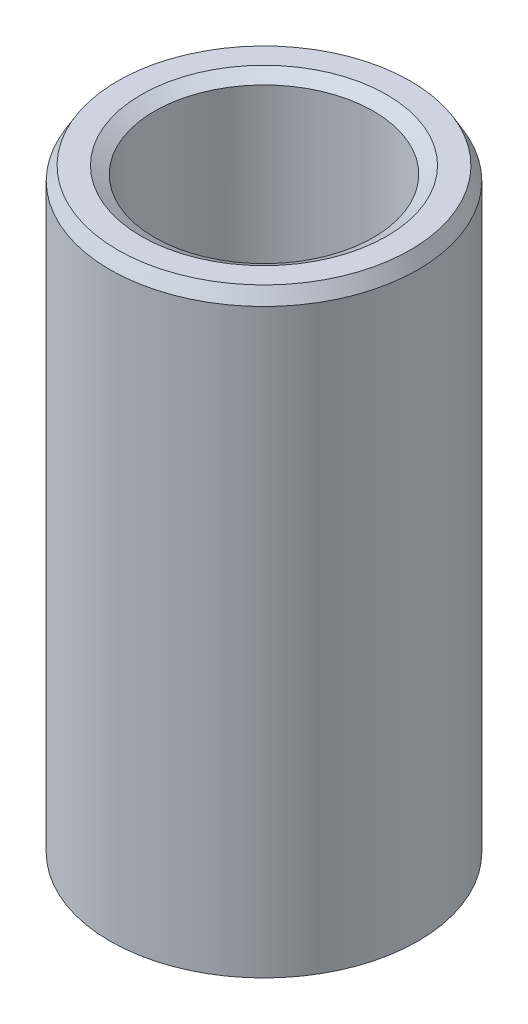
ISO-10303-21;
HEADER;
FILE_DESCRIPTION(('STEP AP214'),'2;1');
FILE_NAME('part.step','',(''),(''),'','','');
FILE_SCHEMA(('AUTOMOTIVE_DESIGN { 1 0 10303 214 1 1 1 1 }'));
ENDSEC;
DATA;
#1=APPLICATION_CONTEXT('core data for automotive mechanical design processes');
#2=APPLICATION_PROTOCOL_DEFINITION('international standard','automotive_design',2000,#1);
#3=PRODUCT_CONTEXT('',#1,'mechanical');
#4=PRODUCT('Part','Part','',(#3));
#5=PRODUCT_RELATED_PRODUCT_CATEGORY('part','',(#4));
#6=PRODUCT_DEFINITION_FORMATION('','',#4);
#7=PRODUCT_DEFINITION_CONTEXT('part definition',#1,'design');
#8=PRODUCT_DEFINITION('design','',#6,#7);
#9=PRODUCT_DEFINITION_SHAPE('','',#8);
#10=(LENGTH_UNIT() NAMED_UNIT(*) SI_UNIT(.MILLI.,.METRE.));
#11=(NAMED_UNIT(*) PLANE_ANGLE_UNIT() SI_UNIT($,.RADIAN.));
#12=(NAMED_UNIT(*) SI_UNIT($,.STERADIAN.) SOLID_ANGLE_UNIT());
#13=UNCERTAINTY_MEASURE_WITH_UNIT(LENGTH_MEASURE(1.E-05),#10,'distance_accuracy_value','');
#14=(GEOMETRIC_REPRESENTATION_CONTEXT(3) GLOBAL_UNCERTAINTY_ASSIGNED_CONTEXT((#13)) GLOBAL_UNIT_ASSIGNED_CONTEXT((#10,
#11,#12)) REPRESENTATION_CONTEXT('',''));
#15=CARTESIAN_POINT('',(0.,0.,0.));
#16=DIRECTION('',(0.,0.,1.));
#17=DIRECTION('',(1.,0.,0.));
#18=AXIS2_PLACEMENT_3D('',#15,#16,#17);
#19=CARTESIAN_POINT('',(0.,58.6751234788739,0.));
#20=DIRECTION('',(0.,-1.,0.));
#21=DIRECTION('',(0.,0.,-1.));
#22=AXIS2_PLACEMENT_3D('',#19,#20,#21);
#23=CYLINDRICAL_SURFACE('',#22,15.);
#24=CARTESIAN_POINT('',(0.,0.746168549579422,0.));
#25=DIRECTION('',(0.,1.,0.));
#26=DIRECTION('',(0.,0.,1.));
#27=AXIS2_PLACEMENT_3D('',#24,#25,#26);
#28=CIRCLE('',#27,15.);
#29=CARTESIAN_POINT('',(0.,0.746168549579422,-15.));
#30=VERTEX_POINT('',#29);
#31=EDGE_CURVE('E10',#30,#30,#28,.T.);
#32=CARTESIAN_POINT('',(0.,57.3827216399925,0.));
#33=DIRECTION('',(0.,1.,0.));
#34=DIRECTION('',(0.,0.,1.));
#35=AXIS2_PLACEMENT_3D('',#32,#33,#34);
#36=CIRCLE('',#35,15.);
#37=CARTESIAN_POINT('',(0.,57.3827216399925,-15.));
#38=VERTEX_POINT('',#37);
#39=EDGE_CURVE('E50',#38,#38,#36,.F.);
#40=CARTESIAN_POINT('',(0.,0.746168549579422,-15.));
#41=CARTESIAN_POINT('',(0.,1.33613264427123,-15.));
#42=CARTESIAN_POINT('',(0.,1.92609673896303,-15.));
#43=CARTESIAN_POINT('',(0.,3.10602492834663,-15.));
#44=CARTESIAN_POINT('',(0.,3.69598902303844,-15.));
#45=CARTESIAN_POINT('',(0.,4.87591721242204,-15.));
#46=CARTESIAN_POINT('',(0.,5.46588130711384,-15.));
#47=CARTESIAN_POINT('',(0.,6.64580949649745,-15.));
#48=CARTESIAN_POINT('',(0.,7.23577359118925,-15.));
#49=CARTESIAN_POINT('',(0.,8.41570178057286,-15.));
#50=CARTESIAN_POINT('',(0.,9.00566587526466,-15.));
#51=CARTESIAN_POINT('',(0.,10.1855940646483,-15.));
#52=CARTESIAN_POINT('',(0.,10.7755581593401,-15.));
#53=CARTESIAN_POINT('',(0.,11.9554863487237,-15.));
#54=CARTESIAN_POINT('',(0.,12.5454504434155,-15.));
#55=CARTESIAN_POINT('',(0.,13.7253786327991,-15.));
#56=CARTESIAN_POINT('',(0.,14.3153427274909,-15.));
#57=CARTESIAN_POINT('',(0.,15.4952709168745,-15.));
#58=CARTESIAN_POINT('',(0.,16.0852350115663,-15.));
#59=CARTESIAN_POINT('',(0.,17.2651632009499,-15.));
#60=CARTESIAN_POINT('',(0.,17.8551272956417,-15.));
#61=CARTESIAN_POINT('',(0.,19.0350554850253,-15.));
#62=CARTESIAN_POINT('',(0.,19.6250195797171,-15.));
#63=CARTESIAN_POINT('',(0.,20.8049477691007,-15.));
#64=CARTESIAN_POINT('',(0.,21.3949118637925,-15.));
#65=CARTESIAN_POINT('',(0.,22.5748400531761,-15.));
#66=CARTESIAN_POINT('',(0.,23.1648041478679,-15.));
#67=CARTESIAN_POINT('',(0.,24.3447323372515,-15.));
#68=CARTESIAN_POINT('',(0.,24.9346964319433,-15.));
#69=CARTESIAN_POINT('',(0.,26.1146246213269,-15.));
#70=CARTESIAN_POINT('',(0.,26.7045887160187,-15.));
#71=CARTESIAN_POINT('',(0.,27.8845169054024,-15.));
#72=CARTESIAN_POINT('',(0.,28.4744810000942,-15.));
#73=CARTESIAN_POINT('',(0.,29.6544091894778,-15.));
#74=CARTESIAN_POINT('',(0.,30.2443732841696,-15.));
#75=CARTESIAN_POINT('',(0.,31.4243014735532,-15.));
#76=CARTESIAN_POINT('',(0.,32.014265568245,-15.));
#77=CARTESIAN_POINT('',(0.,33.1941937576286,-15.));
#78=CARTESIAN_POINT('',(0.,33.7841578523204,-15.));
#79=CARTESIAN_POINT('',(0.,34.964086041704,-15.));
#80=CARTESIAN_POINT('',(0.,35.5540501363958,-15.));
#81=CARTESIAN_POINT('',(0.,36.7339783257794,-15.));
#82=CARTESIAN_POINT('',(0.,37.3239424204712,-15.));
#83=CARTESIAN_POINT('',(0.,38.5038706098548,-15.));
#84=CARTESIAN_POINT('',(0.,39.0938347045466,-15.));
#85=CARTESIAN_POINT('',(0.,40.2737628939302,-15.));
#86=CARTESIAN_POINT('',(0.,40.863726988622,-15.));
#87=CARTESIAN_POINT('',(0.,42.0436551780056,-15.));
#88=CARTESIAN_POINT('',(0.,42.6336192726974,-15.));
#89=CARTESIAN_POINT('',(0.,43.813547462081,-15.));
#90=CARTESIAN_POINT('',(0.,44.4035115567728,-15.));
#91=CARTESIAN_POINT('',(0.,45.5834397461564,-15.));
#92=CARTESIAN_POINT('',(0.,46.1734038408482,-15.));
#93=CARTESIAN_POINT('',(0.,47.3533320302318,-15.));
#94=CARTESIAN_POINT('',(0.,47.9432961249236,-15.));
#95=CARTESIAN_POINT('',(0.,49.1232243143072,-15.));
#96=CARTESIAN_POINT('',(0.,49.7131884089991,-15.));
#97=CARTESIAN_POINT('',(0.,50.8931165983827,-15.));
#98=CARTESIAN_POINT('',(0.,51.4830806930745,-15.));
#99=CARTESIAN_POINT('',(0.,52.6630088824581,-15.));
#100=CARTESIAN_POINT('',(0.,53.2529729771499,-15.));
#101=CARTESIAN_POINT('',(0.,54.4329011665335,-15.));
#102=CARTESIAN_POINT('',(0.,55.0228652612253,-15.));
#103=CARTESIAN_POINT('',(0.,56.2027934506089,-15.));
#104=CARTESIAN_POINT('',(0.,56.7927575453007,-15.));
#105=CARTESIAN_POINT('',(0.,57.3827216399925,-15.));
#106=B_SPLINE_CURVE_WITH_KNOTS('',3,(#40,#41,#42,#43,#44,#45,#46,#47,#48,#49,#50,#51,#52,#53,
#54,#55,#56,#57,#58,#59,#60,#61,#62,#63,#64,#65,#66,#67,#68,#69,#70,#71,#72,#73,#74,#75,#76,#77,
#78,#79,#80,#81,#82,#83,#84,#85,#86,#87,#88,#89,#90,#91,#92,#93,#94,#95,#96,#97,#98,#99,#100,
#101,#102,#103,#104,#105),.UNSPECIFIED.,.F.,.F.,(4,2,2,2,2,2,2,2,2,2,2,2,2,2,2,2,2,2,2,2,2,2,2,
2,2,2,2,2,2,2,2,2,4),(0.,1.76989228407541,3.53978456815082,5.30967685222623,7.07956913630163,
8.84946142037704,10.6193537044525,12.3892459885279,14.1591382726033,15.9290305566787,
17.6989228407541,19.4688151248295,21.2387074089049,23.0085996929803,24.7784919770557,
26.5483842611311,28.3182765452065,30.0881688292819,31.8580611133574,33.6279533974328,
35.3978456815082,37.1677379655836,38.937630249659,40.7075225337344,42.4774148178098,
44.2473071018852,46.0171993859606,47.787091670036,49.5569839541114,51.3268762381868,
53.0967685222623,54.8666608063377,56.6365530904131),.UNSPECIFIED.);
#107=EDGE_CURVE('BSEAM39',#30,#38,#106,.T.);
#108=ORIENTED_EDGE('',*,*,#31,.T.);
#109=ORIENTED_EDGE('',*,*,#39,.T.);
#110=ORIENTED_EDGE('',*,*,#107,.T.);
#111=ORIENTED_EDGE('',*,*,#107,.F.);
#112=EDGE_LOOP('',(#108,#110,#109,#111));
#113=FACE_BOUND('',#112,.T.);
#114=ADVANCED_FACE('F39',(#113),#23,.T.);
#115=CARTESIAN_POINT('',(0.,58.6751234788739,0.));
#116=DIRECTION('',(0.,1.,0.));
#117=DIRECTION('',(0.,0.,1.));
#118=AXIS2_PLACEMENT_3D('',#115,#116,#117);
#119=PLANE('',#118);
#120=CARTESIAN_POINT('',(0.,58.6751234788739,0.));
#121=DIRECTION('',(0.,1.,0.));
#122=DIRECTION('',(0.,0.,1.));
#123=AXIS2_PLACEMENT_3D('',#120,#121,#122);
#124=CIRCLE('',#123,11.9536355341758);
#125=CARTESIAN_POINT('',(0.,58.6751234788739,11.9536355341758));
#126=VERTEX_POINT('',#125);
#127=EDGE_CURVE('E58',#126,#126,#124,.F.);
#128=ORIENTED_EDGE('',*,*,#127,.T.);
#129=EDGE_LOOP('',(#128));
#130=FACE_BOUND('',#129,.T.);
#131=CARTESIAN_POINT('',(0.,58.6751234788739,0.));
#132=DIRECTION('',(0.,1.,0.));
#133=DIRECTION('',(0.,0.,1.));
#134=AXIS2_PLACEMENT_3D('',#131,#132,#133);
#135=CIRCLE('',#134,14.2538314504206);
#136=CARTESIAN_POINT('',(0.,58.6751234788739,14.2538314504206));
#137=VERTEX_POINT('',#136);
#138=EDGE_CURVE('E61',#137,#137,#135,.T.);
#139=ORIENTED_EDGE('',*,*,#138,.T.);
#140=EDGE_LOOP('',(#139));
#141=FACE_BOUND('',#140,.T.);
#142=ADVANCED_FACE('F88',(#130,#141),#119,.T.);
#143=CARTESIAN_POINT('',(0.,0.,0.));
#144=DIRECTION('',(0.,1.,0.));
#145=DIRECTION('',(0.,0.,1.));
#146=AXIS2_PLACEMENT_3D('',#143,#144,#145);
#147=PLANE('',#146);
#148=CARTESIAN_POINT('',(0.,0.,0.));
#149=DIRECTION('',(0.,1.,0.));
#150=DIRECTION('',(0.,0.,1.));
#151=AXIS2_PLACEMENT_3D('',#148,#149,#150);
#152=CIRCLE('',#151,11.4074022448736);
#153=CARTESIAN_POINT('',(0.,0.,11.4074022448736));
#154=VERTEX_POINT('',#153);
#155=EDGE_CURVE('E51',#154,#154,#152,.T.);
#156=ORIENTED_EDGE('',*,*,#155,.T.);
#157=EDGE_LOOP('',(#156));
#158=FACE_BOUND('',#157,.T.);
#159=CARTESIAN_POINT('',(0.,0.,0.));
#160=DIRECTION('',(0.,1.,0.));
#161=DIRECTION('',(0.,0.,1.));
#162=AXIS2_PLACEMENT_3D('',#159,#160,#161);
#163=CIRCLE('',#162,13.7075981611185);
#164=CARTESIAN_POINT('',(0.,0.,13.7075981611185));
#165=VERTEX_POINT('',#164);
#166=EDGE_CURVE('E54',#165,#165,#163,.F.);
#167=ORIENTED_EDGE('',*,*,#166,.T.);
#168=EDGE_LOOP('',(#167));
#169=FACE_BOUND('',#168,.T.);
#170=ADVANCED_FACE('F83',(#158,#169),#147,.F.);
#171=CARTESIAN_POINT('',(0.,58.6751234788739,0.));
#172=DIRECTION('',(0.,-1.,0.));
#173=DIRECTION('',(0.,0.,-1.));
#174=AXIS2_PLACEMENT_3D('',#171,#172,#173);
#175=CYLINDRICAL_SURFACE('',#174,10.6612336952942);
#176=CARTESIAN_POINT('',(0.,57.9289549292945,0.));
#177=DIRECTION('',(0.,1.,0.));
#178=DIRECTION('',(0.,0.,1.));
#179=AXIS2_PLACEMENT_3D('',#176,#177,#178);
#180=CIRCLE('',#179,10.6612336952942);
#181=CARTESIAN_POINT('',(0.,57.9289549292945,-10.6612336952942));
#182=VERTEX_POINT('',#181);
#183=EDGE_CURVE('E67',#182,#182,#180,.T.);
#184=CARTESIAN_POINT('',(0.,1.29240183888149,0.));
#185=DIRECTION('',(0.,1.,0.));
#186=DIRECTION('',(0.,0.,1.));
#187=AXIS2_PLACEMENT_3D('',#184,#185,#186);
#188=CIRCLE('',#187,10.6612336952942);
#189=CARTESIAN_POINT('',(0.,1.29240183888148,-10.6612336952942));
#190=VERTEX_POINT('',#189);
#191=EDGE_CURVE('E69',#190,#190,#188,.F.);
#192=CARTESIAN_POINT('',(0.,57.9289549292945,-10.6612336952942));
#193=CARTESIAN_POINT('',(0.,57.3389908346027,-10.6612336952942));
#194=CARTESIAN_POINT('',(0.,56.7490267399109,-10.6612336952942));
#195=CARTESIAN_POINT('',(0.,55.5690985505273,-10.6612336952942));
#196=CARTESIAN_POINT('',(0.,54.9791344558355,-10.6612336952942));
#197=CARTESIAN_POINT('',(0.,53.7992062664519,-10.6612336952942));
#198=CARTESIAN_POINT('',(0.,53.2092421717601,-10.6612336952942));
#199=CARTESIAN_POINT('',(0.,52.0293139823765,-10.6612336952942));
#200=CARTESIAN_POINT('',(0.,51.4393498876847,-10.6612336952942));
#201=CARTESIAN_POINT('',(0.,50.2594216983011,-10.6612336952942));
#202=CARTESIAN_POINT('',(0.,49.6694576036093,-10.6612336952942));
#203=CARTESIAN_POINT('',(0.,48.4895294142257,-10.6612336952942));
#204=CARTESIAN_POINT('',(0.,47.8995653195339,-10.6612336952942));
#205=CARTESIAN_POINT('',(0.,46.7196371301503,-10.6612336952942));
#206=CARTESIAN_POINT('',(0.,46.1296730354585,-10.6612336952942));
#207=CARTESIAN_POINT('',(0.,44.9497448460749,-10.6612336952942));
#208=CARTESIAN_POINT('',(0.,44.3597807513831,-10.6612336952942));
#209=CARTESIAN_POINT('',(0.,43.1798525619995,-10.6612336952942));
#210=CARTESIAN_POINT('',(0.,42.5898884673077,-10.6612336952942));
#211=CARTESIAN_POINT('',(0.,41.409960277924,-10.6612336952942));
#212=CARTESIAN_POINT('',(0.,40.8199961832322,-10.6612336952942));
#213=CARTESIAN_POINT('',(0.,39.6400679938486,-10.6612336952942));
#214=CARTESIAN_POINT('',(0.,39.0501038991568,-10.6612336952942));
#215=CARTESIAN_POINT('',(0.,37.8701757097732,-10.6612336952942));
#216=CARTESIAN_POINT('',(0.,37.2802116150814,-10.6612336952942));
#217=CARTESIAN_POINT('',(0.,36.1002834256978,-10.6612336952942));
#218=CARTESIAN_POINT('',(0.,35.510319331006,-10.6612336952942));
#219=CARTESIAN_POINT('',(0.,34.3303911416224,-10.6612336952942));
#220=CARTESIAN_POINT('',(0.,33.7404270469306,-10.6612336952942));
#221=CARTESIAN_POINT('',(0.,32.560498857547,-10.6612336952942));
#222=CARTESIAN_POINT('',(0.,31.9705347628552,-10.6612336952942));
#223=CARTESIAN_POINT('',(0.,30.7906065734716,-10.6612336952942));
#224=CARTESIAN_POINT('',(0.,30.2006424787798,-10.6612336952942));
#225=CARTESIAN_POINT('',(0.,29.0207142893962,-10.6612336952942));
#226=CARTESIAN_POINT('',(0.,28.4307501947044,-10.6612336952942));
#227=CARTESIAN_POINT('',(0.,27.2508220053208,-10.6612336952942));
#228=CARTESIAN_POINT('',(0.,26.660857910629,-10.6612336952942));
#229=CARTESIAN_POINT('',(0.,25.4809297212454,-10.6612336952942));
#230=CARTESIAN_POINT('',(0.,24.8909656265536,-10.6612336952942));
#231=CARTESIAN_POINT('',(0.,23.71103743717,-10.6612336952942));
#232=CARTESIAN_POINT('',(0.,23.1210733424782,-10.6612336952942));
#233=CARTESIAN_POINT('',(0.,21.9411451530946,-10.6612336952942));
#234=CARTESIAN_POINT('',(0.,21.3511810584028,-10.6612336952942));
#235=CARTESIAN_POINT('',(0.,20.1712528690192,-10.6612336952942));
#236=CARTESIAN_POINT('',(0.,19.5812887743274,-10.6612336952942));
#237=CARTESIAN_POINT('',(0.,18.4013605849438,-10.6612336952942));
#238=CARTESIAN_POINT('',(0.,17.811396490252,-10.6612336952942));
#239=CARTESIAN_POINT('',(0.,16.6314683008684,-10.6612336952942));
#240=CARTESIAN_POINT('',(0.,16.0415042061766,-10.6612336952942));
#241=CARTESIAN_POINT('',(0.,14.8615760167929,-10.6612336952942));
#242=CARTESIAN_POINT('',(0.,14.2716119221011,-10.6612336952942));
#243=CARTESIAN_POINT('',(0.,13.0916837327175,-10.6612336952942));
#244=CARTESIAN_POINT('',(0.,12.5017196380257,-10.6612336952942));
#245=CARTESIAN_POINT('',(0.,11.3217914486421,-10.6612336952942));
#246=CARTESIAN_POINT('',(0.,10.7318273539503,-10.6612336952942));
#247=CARTESIAN_POINT('',(0.,9.55189916456672,-10.6612336952942));
#248=CARTESIAN_POINT('',(0.,8.96193506987492,-10.6612336952942));
#249=CARTESIAN_POINT('',(0.,7.78200688049131,-10.6612336952942));
#250=CARTESIAN_POINT('',(0.,7.19204278579951,-10.6612336952942));
#251=CARTESIAN_POINT('',(0.,6.0121145964159,-10.6612336952942));
#252=CARTESIAN_POINT('',(0.,5.42215050172411,-10.6612336952942));
#253=CARTESIAN_POINT('',(0.,4.2422223123405,-10.6612336952942));
#254=CARTESIAN_POINT('',(0.,3.6522582176487,-10.6612336952942));
#255=CARTESIAN_POINT('',(0.,2.47233002826509,-10.6612336952942));
#256=CARTESIAN_POINT('',(0.,1.88236593357329,-10.6612336952942));
#257=CARTESIAN_POINT('',(0.,1.29240183888148,-10.6612336952942));
#258=B_SPLINE_CURVE_WITH_KNOTS('',3,(#192,#193,#194,#195,#196,#197,#198,#199,#200,#201,#202,
#203,#204,#205,#206,#207,#208,#209,#210,#211,#212,#213,#214,#215,#216,#217,#218,#219,#220,#221,
#222,#223,#224,#225,#226,#227,#228,#229,#230,#231,#232,#233,#234,#235,#236,#237,#238,#239,#240,
#241,#242,#243,#244,#245,#246,#247,#248,#249,#250,#251,#252,#253,#254,#255,#256,#257),
.UNSPECIFIED.,.F.,.F.,(4,2,2,2,2,2,2,2,2,2,2,2,2,2,2,2,2,2,2,2,2,2,2,2,2,2,2,2,2,2,2,2,4),(0.,
1.76989228407541,3.53978456815082,5.30967685222623,7.07956913630163,8.84946142037703,
10.6193537044524,12.3892459885279,14.1591382726033,15.9290305566787,17.6989228407541,
19.4688151248295,21.2387074089049,23.0085996929803,24.7784919770557,26.5483842611311,
28.3182765452065,30.0881688292819,31.8580611133573,33.6279533974327,35.3978456815081,
37.1677379655835,38.937630249659,40.7075225337344,42.4774148178098,44.2473071018852,
46.0171993859606,47.787091670036,49.5569839541114,51.3268762381868,53.0967685222622,
54.8666608063376,56.636553090413),.UNSPECIFIED.);
#259=EDGE_CURVE('BSEAM71',#182,#190,#258,.T.);
#260=ORIENTED_EDGE('',*,*,#183,.T.);
#261=ORIENTED_EDGE('',*,*,#191,.T.);
#262=ORIENTED_EDGE('',*,*,#259,.T.);
#263=ORIENTED_EDGE('',*,*,#259,.F.);
#264=EDGE_LOOP('',(#260,#262,#261,#263));
#265=FACE_BOUND('',#264,.T.);
#266=ADVANCED_FACE('F71',(#265),#175,.F.);
#267=CARTESIAN_POINT('',(0.,57.9289549292945,0.));
#268=DIRECTION('',(0.,1.,0.));
#269=DIRECTION('',(0.,0.,1.));
#270=AXIS2_PLACEMENT_3D('',#267,#268,#269);
#271=CONICAL_SURFACE('',#270,10.6612336952942,1.04719755119661);
#272=ORIENTED_EDGE('',*,*,#127,.F.);
#273=EDGE_LOOP('',(#272));
#274=FACE_BOUND('',#273,.T.);
#275=ORIENTED_EDGE('',*,*,#183,.F.);
#276=EDGE_LOOP('',(#275));
#277=FACE_BOUND('',#276,.T.);
#278=ADVANCED_FACE('F77',(#274,#277),#271,.F.);
#279=CARTESIAN_POINT('',(0.,0.,0.));
#280=DIRECTION('',(0.,-1.,0.));
#281=DIRECTION('',(0.,0.,-1.));
#282=AXIS2_PLACEMENT_3D('',#279,#280,#281);
#283=CONICAL_SURFACE('',#282,11.4074022448736,0.523598775598293);
#284=ORIENTED_EDGE('',*,*,#191,.F.);
#285=EDGE_LOOP('',(#284));
#286=FACE_BOUND('',#285,.T.);
#287=ORIENTED_EDGE('',*,*,#155,.F.);
#288=EDGE_LOOP('',(#287));
#289=FACE_BOUND('',#288,.T.);
#290=ADVANCED_FACE('F73',(#286,#289),#283,.F.);
#291=CARTESIAN_POINT('',(0.,0.746168549579422,0.));
#292=DIRECTION('',(0.,1.,0.));
#293=DIRECTION('',(0.,0.,1.));
#294=AXIS2_PLACEMENT_3D('',#291,#292,#293);
#295=CONICAL_SURFACE('',#294,15.,1.0471975511966);
#296=ORIENTED_EDGE('',*,*,#166,.F.);
#297=EDGE_LOOP('',(#296));
#298=FACE_BOUND('',#297,.T.);
#299=ORIENTED_EDGE('',*,*,#31,.F.);
#300=EDGE_LOOP('',(#299));
#301=FACE_BOUND('',#300,.T.);
#302=ADVANCED_FACE('F76',(#298,#301),#295,.T.);
#303=CARTESIAN_POINT('',(0.,58.6751234788739,0.));
#304=DIRECTION('',(0.,-1.,0.));
#305=DIRECTION('',(0.,0.,-1.));
#306=AXIS2_PLACEMENT_3D('',#303,#304,#305);
#307=CONICAL_SURFACE('',#306,14.2538314504206,0.5235987755983);
#308=ORIENTED_EDGE('',*,*,#39,.F.);
#309=EDGE_LOOP('',(#308));
#310=FACE_BOUND('',#309,.T.);
#311=ORIENTED_EDGE('',*,*,#138,.F.);
#312=EDGE_LOOP('',(#311));
#313=FACE_BOUND('',#312,.T.);
#314=ADVANCED_FACE('F45',(#310,#313),#307,.T.);
#315=CLOSED_SHELL('',(#114,#142,#170,#266,#278,#290,#302,#314));
#316=MANIFOLD_SOLID_BREP('B2',#315);
#317=ADVANCED_BREP_SHAPE_REPRESENTATION('',(#18,#316),#14);
#318=SHAPE_DEFINITION_REPRESENTATION(#9,#317);
ENDSEC;
END-ISO-10303-21;
